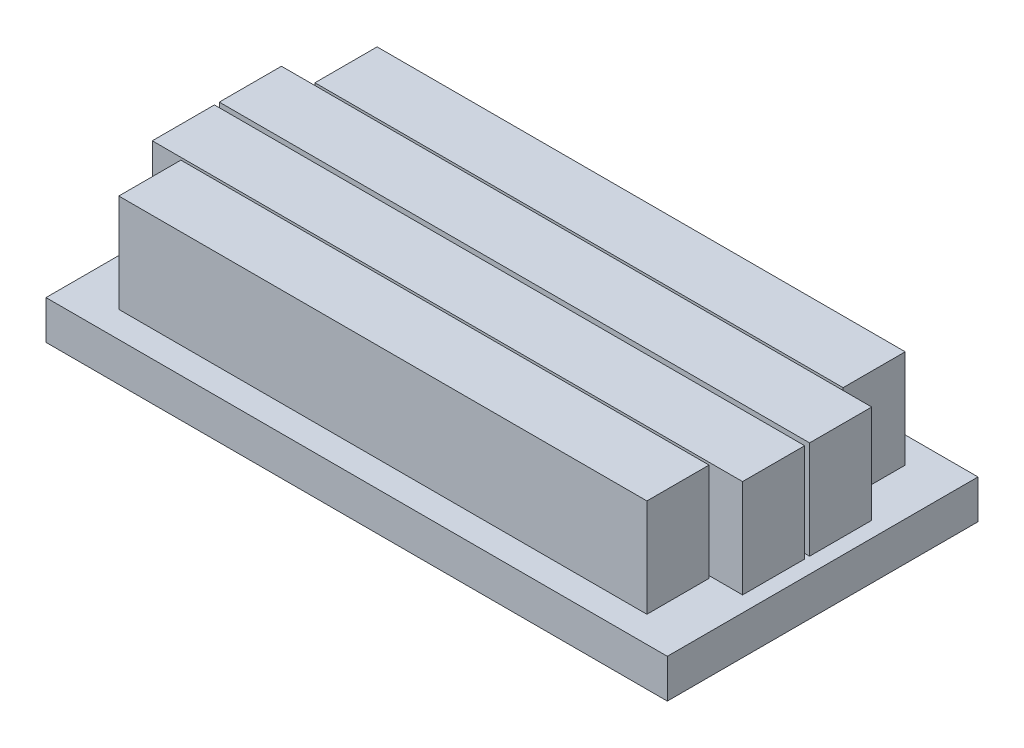
ISO-10303-21;
HEADER;
FILE_DESCRIPTION(('STEP AP214'),'2;1');
FILE_NAME('part.step','',(''),(''),'','','');
FILE_SCHEMA(('AUTOMOTIVE_DESIGN { 1 0 10303 214 1 1 1 1 }'));
ENDSEC;
DATA;
#1=APPLICATION_CONTEXT('core data for automotive mechanical design processes');
#2=APPLICATION_PROTOCOL_DEFINITION('international standard','automotive_design',2000,#1);
#3=PRODUCT_CONTEXT('',#1,'mechanical');
#4=PRODUCT('Part','Part','',(#3));
#5=PRODUCT_RELATED_PRODUCT_CATEGORY('part','',(#4));
#6=PRODUCT_DEFINITION_FORMATION('','',#4);
#7=PRODUCT_DEFINITION_CONTEXT('part definition',#1,'design');
#8=PRODUCT_DEFINITION('design','',#6,#7);
#9=PRODUCT_DEFINITION_SHAPE('','',#8);
#10=(LENGTH_UNIT() NAMED_UNIT(*) SI_UNIT(.MILLI.,.METRE.));
#11=(NAMED_UNIT(*) PLANE_ANGLE_UNIT() SI_UNIT($,.RADIAN.));
#12=(NAMED_UNIT(*) SI_UNIT($,.STERADIAN.) SOLID_ANGLE_UNIT());
#13=UNCERTAINTY_MEASURE_WITH_UNIT(LENGTH_MEASURE(1.E-05),#10,'distance_accuracy_value','');
#14=(GEOMETRIC_REPRESENTATION_CONTEXT(3) GLOBAL_UNCERTAINTY_ASSIGNED_CONTEXT((#13)) GLOBAL_UNIT_ASSIGNED_CONTEXT((#10,
#11,#12)) REPRESENTATION_CONTEXT('',''));
#15=CARTESIAN_POINT('',(0.,0.,0.));
#16=DIRECTION('',(0.,0.,1.));
#17=DIRECTION('',(1.,0.,0.));
#18=AXIS2_PLACEMENT_3D('',#15,#16,#17);
#19=CARTESIAN_POINT('',(0.,1.5875,0.));
#20=DIRECTION('',(0.,-1.,0.));
#21=DIRECTION('',(0.,0.,-1.));
#22=AXIS2_PLACEMENT_3D('',#19,#20,#21);
#23=PLANE('',#22);
#24=DIRECTION('',(-1.,0.,0.));
#25=VECTOR('',#24,1.);
#26=CARTESIAN_POINT('',(-10.795,1.5875,-2.74));
#27=LINE('',#26,#25);
#28=CARTESIAN_POINT('',(10.795,1.5875,-2.74));
#29=VERTEX_POINT('',#28);
#30=CARTESIAN_POINT('',(-10.795,1.5875,-2.74));
#31=VERTEX_POINT('',#30);
#32=EDGE_CURVE('E201',#29,#31,#27,.T.);
#33=ORIENTED_EDGE('',*,*,#32,.T.);
#34=DIRECTION('',(0.,0.,-1.));
#35=VECTOR('',#34,1.);
#36=CARTESIAN_POINT('',(-10.795,1.5875,-5.28000000000001));
#37=LINE('',#36,#35);
#38=CARTESIAN_POINT('',(-10.795,1.5875,-5.28000000000001));
#39=VERTEX_POINT('',#38);
#40=EDGE_CURVE('E175',#31,#39,#37,.T.);
#41=ORIENTED_EDGE('',*,*,#40,.T.);
#42=DIRECTION('',(1.,0.,0.));
#43=VECTOR('',#42,1.);
#44=CARTESIAN_POINT('',(-10.795,1.5875,-5.28000000000001));
#45=LINE('',#44,#43);
#46=CARTESIAN_POINT('',(10.795,1.5875,-5.28000000000001));
#47=VERTEX_POINT('',#46);
#48=EDGE_CURVE('E191',#39,#47,#45,.T.);
#49=ORIENTED_EDGE('',*,*,#48,.T.);
#50=DIRECTION('',(0.,0.,1.));
#51=VECTOR('',#50,1.);
#52=CARTESIAN_POINT('',(10.795,1.5875,-5.28000000000001));
#53=LINE('',#52,#51);
#54=EDGE_CURVE('E47',#47,#29,#53,.T.);
#55=ORIENTED_EDGE('',*,*,#54,.T.);
#56=EDGE_LOOP('',(#33,#41,#49,#55));
#57=FACE_BOUND('',#56,.T.);
#58=DIRECTION('',(-1.,0.,0.));
#59=VECTOR('',#58,1.);
#60=CARTESIAN_POINT('',(-12.065,1.5875,-0.0999999999999998));
#61=LINE('',#60,#59);
#62=CARTESIAN_POINT('',(12.065,1.5875,-0.0999999999999998));
#63=VERTEX_POINT('',#62);
#64=CARTESIAN_POINT('',(-12.065,1.5875,-0.0999999999999998));
#65=VERTEX_POINT('',#64);
#66=EDGE_CURVE('E226',#63,#65,#61,.T.);
#67=ORIENTED_EDGE('',*,*,#66,.T.);
#68=DIRECTION('',(0.,0.,-1.));
#69=VECTOR('',#68,1.);
#70=CARTESIAN_POINT('',(-12.065,1.5875,-0.0999999999999998));
#71=LINE('',#70,#69);
#72=CARTESIAN_POINT('',(-12.065,1.5875,-2.64));
#73=VERTEX_POINT('',#72);
#74=EDGE_CURVE('E180',#65,#73,#71,.T.);
#75=ORIENTED_EDGE('',*,*,#74,.T.);
#76=DIRECTION('',(1.,0.,0.));
#77=VECTOR('',#76,1.);
#78=CARTESIAN_POINT('',(-12.065,1.5875,-2.64));
#79=LINE('',#78,#77);
#80=CARTESIAN_POINT('',(12.065,1.5875,-2.64));
#81=VERTEX_POINT('',#80);
#82=EDGE_CURVE('E214',#73,#81,#79,.T.);
#83=ORIENTED_EDGE('',*,*,#82,.T.);
#84=DIRECTION('',(0.,0.,1.));
#85=VECTOR('',#84,1.);
#86=CARTESIAN_POINT('',(12.065,1.5875,-0.0999999999999998));
#87=LINE('',#86,#85);
#88=EDGE_CURVE('E55',#81,#63,#87,.T.);
#89=ORIENTED_EDGE('',*,*,#88,.T.);
#90=EDGE_LOOP('',(#67,#75,#83,#89));
#91=FACE_BOUND('',#90,.T.);
#92=DIRECTION('',(0.,0.,1.));
#93=VECTOR('',#92,1.);
#94=CARTESIAN_POINT('',(-12.065,1.5875,0.0999999999999998));
#95=LINE('',#94,#93);
#96=CARTESIAN_POINT('',(-12.065,1.5875,0.0999999999999998));
#97=VERTEX_POINT('',#96);
#98=CARTESIAN_POINT('',(-12.065,1.5875,2.64));
#99=VERTEX_POINT('',#98);
#100=EDGE_CURVE('E272',#97,#99,#95,.T.);
#101=ORIENTED_EDGE('',*,*,#100,.F.);
#102=DIRECTION('',(-1.,0.,0.));
#103=VECTOR('',#102,1.);
#104=CARTESIAN_POINT('',(-12.065,1.5875,0.0999999999999998));
#105=LINE('',#104,#103);
#106=CARTESIAN_POINT('',(12.065,1.5875,0.0999999999999998));
#107=VERTEX_POINT('',#106);
#108=EDGE_CURVE('E277',#107,#97,#105,.T.);
#109=ORIENTED_EDGE('',*,*,#108,.F.);
#110=DIRECTION('',(0.,0.,-1.));
#111=VECTOR('',#110,1.);
#112=CARTESIAN_POINT('',(12.065,1.5875,0.0999999999999998));
#113=LINE('',#112,#111);
#114=CARTESIAN_POINT('',(12.065,1.5875,2.64));
#115=VERTEX_POINT('',#114);
#116=EDGE_CURVE('E289',#115,#107,#113,.T.);
#117=ORIENTED_EDGE('',*,*,#116,.F.);
#118=DIRECTION('',(1.,0.,0.));
#119=VECTOR('',#118,1.);
#120=CARTESIAN_POINT('',(-12.065,1.5875,2.64));
#121=LINE('',#120,#119);
#122=EDGE_CURVE('E286',#99,#115,#121,.T.);
#123=ORIENTED_EDGE('',*,*,#122,.F.);
#124=EDGE_LOOP('',(#101,#109,#117,#123));
#125=FACE_BOUND('',#124,.T.);
#126=DIRECTION('',(0.,0.,1.));
#127=VECTOR('',#126,1.);
#128=CARTESIAN_POINT('',(-12.7,1.5875,6.35));
#129=LINE('',#128,#127);
#130=CARTESIAN_POINT('',(-12.7,1.5875,-6.35));
#131=VERTEX_POINT('',#130);
#132=CARTESIAN_POINT('',(-12.7,1.5875,6.35));
#133=VERTEX_POINT('',#132);
#134=EDGE_CURVE('E306',#131,#133,#129,.T.);
#135=ORIENTED_EDGE('',*,*,#134,.T.);
#136=DIRECTION('',(1.,0.,0.));
#137=VECTOR('',#136,1.);
#138=CARTESIAN_POINT('',(-12.7,1.5875,6.35));
#139=LINE('',#138,#137);
#140=CARTESIAN_POINT('',(12.7,1.5875,6.35));
#141=VERTEX_POINT('',#140);
#142=EDGE_CURVE('E309',#133,#141,#139,.T.);
#143=ORIENTED_EDGE('',*,*,#142,.T.);
#144=DIRECTION('',(0.,0.,-1.));
#145=VECTOR('',#144,1.);
#146=CARTESIAN_POINT('',(12.7,1.5875,6.35));
#147=LINE('',#146,#145);
#148=CARTESIAN_POINT('',(12.7,1.5875,-6.35));
#149=VERTEX_POINT('',#148);
#150=EDGE_CURVE('E312',#141,#149,#147,.T.);
#151=ORIENTED_EDGE('',*,*,#150,.T.);
#152=DIRECTION('',(-1.,0.,0.));
#153=VECTOR('',#152,1.);
#154=CARTESIAN_POINT('',(-12.7,1.5875,-6.35));
#155=LINE('',#154,#153);
#156=EDGE_CURVE('E314',#149,#131,#155,.T.);
#157=ORIENTED_EDGE('',*,*,#156,.T.);
#158=EDGE_LOOP('',(#135,#143,#151,#157));
#159=FACE_BOUND('',#158,.T.);
#160=DIRECTION('',(0.,0.,1.));
#161=VECTOR('',#160,1.);
#162=CARTESIAN_POINT('',(-10.795,1.5875,5.28000000000001));
#163=LINE('',#162,#161);
#164=CARTESIAN_POINT('',(-10.795,1.5875,2.74));
#165=VERTEX_POINT('',#164);
#166=CARTESIAN_POINT('',(-10.795,1.5875,5.28000000000001));
#167=VERTEX_POINT('',#166);
#168=EDGE_CURVE('E239',#165,#167,#163,.T.);
#169=ORIENTED_EDGE('',*,*,#168,.F.);
#170=DIRECTION('',(-1.,0.,0.));
#171=VECTOR('',#170,1.);
#172=CARTESIAN_POINT('',(-10.795,1.5875,2.74));
#173=LINE('',#172,#171);
#174=CARTESIAN_POINT('',(10.795,1.5875,2.74));
#175=VERTEX_POINT('',#174);
#176=EDGE_CURVE('E244',#175,#165,#173,.T.);
#177=ORIENTED_EDGE('',*,*,#176,.F.);
#178=DIRECTION('',(0.,0.,-1.));
#179=VECTOR('',#178,1.);
#180=CARTESIAN_POINT('',(10.795,1.5875,5.28000000000001));
#181=LINE('',#180,#179);
#182=CARTESIAN_POINT('',(10.795,1.5875,5.28000000000001));
#183=VERTEX_POINT('',#182);
#184=EDGE_CURVE('E256',#183,#175,#181,.T.);
#185=ORIENTED_EDGE('',*,*,#184,.F.);
#186=DIRECTION('',(1.,0.,0.));
#187=VECTOR('',#186,1.);
#188=CARTESIAN_POINT('',(-10.795,1.5875,5.28000000000001));
#189=LINE('',#188,#187);
#190=EDGE_CURVE('E253',#167,#183,#189,.T.);
#191=ORIENTED_EDGE('',*,*,#190,.F.);
#192=EDGE_LOOP('',(#169,#177,#185,#191));
#193=FACE_BOUND('',#192,.T.);
#194=ADVANCED_FACE('F32',(#57,#91,#125,#159,#193),#23,.F.);
#195=CARTESIAN_POINT('',(-12.7,1.5875,6.35));
#196=DIRECTION('',(1.,0.,0.));
#197=DIRECTION('',(0.,0.,-1.));
#198=AXIS2_PLACEMENT_3D('',#195,#196,#197);
#199=PLANE('',#198);
#200=DIRECTION('',(0.,0.,1.));
#201=VECTOR('',#200,1.);
#202=CARTESIAN_POINT('',(-12.7,0.,6.35));
#203=LINE('',#202,#201);
#204=CARTESIAN_POINT('',(-12.7,0.,-6.35));
#205=VERTEX_POINT('',#204);
#206=CARTESIAN_POINT('',(-12.7,0.,6.35));
#207=VERTEX_POINT('',#206);
#208=EDGE_CURVE('E305',#205,#207,#203,.T.);
#209=ORIENTED_EDGE('',*,*,#208,.T.);
#210=DIRECTION('',(0.,-1.,0.));
#211=VECTOR('',#210,1.);
#212=CARTESIAN_POINT('',(-12.7,1.5875,6.35));
#213=LINE('',#212,#211);
#214=EDGE_CURVE('E11',#133,#207,#213,.T.);
#215=ORIENTED_EDGE('',*,*,#214,.F.);
#216=ORIENTED_EDGE('',*,*,#134,.F.);
#217=DIRECTION('',(0.,-1.,0.));
#218=VECTOR('',#217,1.);
#219=CARTESIAN_POINT('',(-12.7,1.5875,-6.35));
#220=LINE('',#219,#218);
#221=EDGE_CURVE('E316',#131,#205,#220,.T.);
#222=ORIENTED_EDGE('',*,*,#221,.T.);
#223=EDGE_LOOP('',(#209,#215,#216,#222));
#224=FACE_BOUND('',#223,.T.);
#225=ADVANCED_FACE('F34',(#224),#199,.F.);
#226=CARTESIAN_POINT('',(-12.7,1.5875,6.35));
#227=DIRECTION('',(0.,0.,-1.));
#228=DIRECTION('',(-1.,0.,0.));
#229=AXIS2_PLACEMENT_3D('',#226,#227,#228);
#230=PLANE('',#229);
#231=DIRECTION('',(1.,0.,0.));
#232=VECTOR('',#231,1.);
#233=CARTESIAN_POINT('',(-12.7,0.,6.35));
#234=LINE('',#233,#232);
#235=CARTESIAN_POINT('',(12.7,0.,6.35));
#236=VERTEX_POINT('',#235);
#237=EDGE_CURVE('E319',#207,#236,#234,.T.);
#238=ORIENTED_EDGE('',*,*,#237,.T.);
#239=DIRECTION('',(0.,-1.,0.));
#240=VECTOR('',#239,1.);
#241=CARTESIAN_POINT('',(12.7,1.5875,6.35));
#242=LINE('',#241,#240);
#243=EDGE_CURVE('E40',#141,#236,#242,.T.);
#244=ORIENTED_EDGE('',*,*,#243,.F.);
#245=ORIENTED_EDGE('',*,*,#142,.F.);
#246=ORIENTED_EDGE('',*,*,#214,.T.);
#247=EDGE_LOOP('',(#238,#244,#245,#246));
#248=FACE_BOUND('',#247,.T.);
#249=ADVANCED_FACE('F349',(#248),#230,.F.);
#250=CARTESIAN_POINT('',(12.7,1.5875,6.35));
#251=DIRECTION('',(-1.,0.,0.));
#252=DIRECTION('',(0.,0.,1.));
#253=AXIS2_PLACEMENT_3D('',#250,#251,#252);
#254=PLANE('',#253);
#255=DIRECTION('',(0.,0.,-1.));
#256=VECTOR('',#255,1.);
#257=CARTESIAN_POINT('',(12.7,0.,6.35));
#258=LINE('',#257,#256);
#259=CARTESIAN_POINT('',(12.7,0.,-6.35));
#260=VERTEX_POINT('',#259);
#261=EDGE_CURVE('E321',#236,#260,#258,.T.);
#262=ORIENTED_EDGE('',*,*,#261,.T.);
#263=DIRECTION('',(0.,-1.,0.));
#264=VECTOR('',#263,1.);
#265=CARTESIAN_POINT('',(12.7,1.5875,-6.35));
#266=LINE('',#265,#264);
#267=EDGE_CURVE('E326',#149,#260,#266,.T.);
#268=ORIENTED_EDGE('',*,*,#267,.F.);
#269=ORIENTED_EDGE('',*,*,#150,.F.);
#270=ORIENTED_EDGE('',*,*,#243,.T.);
#271=EDGE_LOOP('',(#262,#268,#269,#270));
#272=FACE_BOUND('',#271,.T.);
#273=ADVANCED_FACE('F333',(#272),#254,.F.);
#274=CARTESIAN_POINT('',(-12.7,1.5875,-6.35));
#275=DIRECTION('',(0.,0.,1.));
#276=DIRECTION('',(1.,0.,0.));
#277=AXIS2_PLACEMENT_3D('',#274,#275,#276);
#278=PLANE('',#277);
#279=DIRECTION('',(-1.,0.,0.));
#280=VECTOR('',#279,1.);
#281=CARTESIAN_POINT('',(-12.7,0.,-6.35));
#282=LINE('',#281,#280);
#283=EDGE_CURVE('E310',#260,#205,#282,.T.);
#284=ORIENTED_EDGE('',*,*,#283,.T.);
#285=ORIENTED_EDGE('',*,*,#221,.F.);
#286=ORIENTED_EDGE('',*,*,#156,.F.);
#287=ORIENTED_EDGE('',*,*,#267,.T.);
#288=EDGE_LOOP('',(#284,#285,#286,#287));
#289=FACE_BOUND('',#288,.T.);
#290=ADVANCED_FACE('F342',(#289),#278,.F.);
#291=CARTESIAN_POINT('',(0.,0.,0.));
#292=DIRECTION('',(0.,-1.,0.));
#293=DIRECTION('',(0.,0.,-1.));
#294=AXIS2_PLACEMENT_3D('',#291,#292,#293);
#295=PLANE('',#294);
#296=ORIENTED_EDGE('',*,*,#208,.F.);
#297=ORIENTED_EDGE('',*,*,#283,.F.);
#298=ORIENTED_EDGE('',*,*,#261,.F.);
#299=ORIENTED_EDGE('',*,*,#237,.F.);
#300=EDGE_LOOP('',(#296,#297,#298,#299));
#301=FACE_BOUND('',#300,.T.);
#302=ADVANCED_FACE('F339',(#301),#295,.T.);
#303=CARTESIAN_POINT('',(-12.065,5.6007,0.0999999999999998));
#304=DIRECTION('',(1.,0.,0.));
#305=DIRECTION('',(0.,0.,-1.));
#306=AXIS2_PLACEMENT_3D('',#303,#304,#305);
#307=PLANE('',#306);
#308=ORIENTED_EDGE('',*,*,#100,.T.);
#309=DIRECTION('',(0.,-1.,0.));
#310=VECTOR('',#309,1.);
#311=CARTESIAN_POINT('',(-12.065,5.6007,2.64));
#312=LINE('',#311,#310);
#313=CARTESIAN_POINT('',(-12.065,5.6007,2.64));
#314=VERTEX_POINT('',#313);
#315=EDGE_CURVE('E302',#314,#99,#312,.T.);
#316=ORIENTED_EDGE('',*,*,#315,.F.);
#317=DIRECTION('',(0.,0.,1.));
#318=VECTOR('',#317,1.);
#319=CARTESIAN_POINT('',(-12.065,5.6007,0.0999999999999998));
#320=LINE('',#319,#318);
#321=CARTESIAN_POINT('',(-12.065,5.6007,0.0999999999999998));
#322=VERTEX_POINT('',#321);
#323=EDGE_CURVE('E273',#322,#314,#320,.T.);
#324=ORIENTED_EDGE('',*,*,#323,.F.);
#325=DIRECTION('',(0.,-1.,0.));
#326=VECTOR('',#325,1.);
#327=CARTESIAN_POINT('',(-12.065,5.6007,0.0999999999999998));
#328=LINE('',#327,#326);
#329=EDGE_CURVE('E283',#322,#97,#328,.T.);
#330=ORIENTED_EDGE('',*,*,#329,.T.);
#331=EDGE_LOOP('',(#308,#316,#324,#330));
#332=FACE_BOUND('',#331,.T.);
#333=ADVANCED_FACE('F364',(#332),#307,.F.);
#334=CARTESIAN_POINT('',(-12.065,5.6007,2.64));
#335=DIRECTION('',(0.,0.,-1.));
#336=DIRECTION('',(-1.,0.,0.));
#337=AXIS2_PLACEMENT_3D('',#334,#335,#336);
#338=PLANE('',#337);
#339=ORIENTED_EDGE('',*,*,#122,.T.);
#340=DIRECTION('',(0.,-1.,0.));
#341=VECTOR('',#340,1.);
#342=CARTESIAN_POINT('',(12.065,5.6007,2.64));
#343=LINE('',#342,#341);
#344=CARTESIAN_POINT('',(12.065,5.6007,2.64));
#345=VERTEX_POINT('',#344);
#346=EDGE_CURVE('E299',#345,#115,#343,.T.);
#347=ORIENTED_EDGE('',*,*,#346,.F.);
#348=DIRECTION('',(1.,0.,0.));
#349=VECTOR('',#348,1.);
#350=CARTESIAN_POINT('',(-12.065,5.6007,2.64));
#351=LINE('',#350,#349);
#352=EDGE_CURVE('E276',#314,#345,#351,.T.);
#353=ORIENTED_EDGE('',*,*,#352,.F.);
#354=ORIENTED_EDGE('',*,*,#315,.T.);
#355=EDGE_LOOP('',(#339,#347,#353,#354));
#356=FACE_BOUND('',#355,.T.);
#357=ADVANCED_FACE('F383',(#356),#338,.F.);
#358=CARTESIAN_POINT('',(12.065,5.6007,0.0999999999999998));
#359=DIRECTION('',(-1.,0.,0.));
#360=DIRECTION('',(0.,0.,1.));
#361=AXIS2_PLACEMENT_3D('',#358,#359,#360);
#362=PLANE('',#361);
#363=ORIENTED_EDGE('',*,*,#116,.T.);
#364=DIRECTION('',(0.,-1.,0.));
#365=VECTOR('',#364,1.);
#366=CARTESIAN_POINT('',(12.065,5.6007,0.0999999999999998));
#367=LINE('',#366,#365);
#368=CARTESIAN_POINT('',(12.065,5.6007,0.0999999999999998));
#369=VERTEX_POINT('',#368);
#370=EDGE_CURVE('E296',#369,#107,#367,.T.);
#371=ORIENTED_EDGE('',*,*,#370,.F.);
#372=DIRECTION('',(0.,0.,-1.));
#373=VECTOR('',#372,1.);
#374=CARTESIAN_POINT('',(12.065,5.6007,0.0999999999999998));
#375=LINE('',#374,#373);
#376=EDGE_CURVE('E279',#345,#369,#375,.T.);
#377=ORIENTED_EDGE('',*,*,#376,.F.);
#378=ORIENTED_EDGE('',*,*,#346,.T.);
#379=EDGE_LOOP('',(#363,#371,#377,#378));
#380=FACE_BOUND('',#379,.T.);
#381=ADVANCED_FACE('F390',(#380),#362,.F.);
#382=CARTESIAN_POINT('',(-12.065,5.6007,0.0999999999999998));
#383=DIRECTION('',(0.,0.,1.));
#384=DIRECTION('',(1.,0.,0.));
#385=AXIS2_PLACEMENT_3D('',#382,#383,#384);
#386=PLANE('',#385);
#387=ORIENTED_EDGE('',*,*,#108,.T.);
#388=ORIENTED_EDGE('',*,*,#329,.F.);
#389=DIRECTION('',(-1.,0.,0.));
#390=VECTOR('',#389,1.);
#391=CARTESIAN_POINT('',(-12.065,5.6007,0.0999999999999998));
#392=LINE('',#391,#390);
#393=EDGE_CURVE('E281',#369,#322,#392,.T.);
#394=ORIENTED_EDGE('',*,*,#393,.F.);
#395=ORIENTED_EDGE('',*,*,#370,.T.);
#396=EDGE_LOOP('',(#387,#388,#394,#395));
#397=FACE_BOUND('',#396,.T.);
#398=ADVANCED_FACE('F397',(#397),#386,.F.);
#399=CARTESIAN_POINT('',(0.,5.6007,0.));
#400=DIRECTION('',(0.,1.,0.));
#401=DIRECTION('',(0.,0.,1.));
#402=AXIS2_PLACEMENT_3D('',#399,#400,#401);
#403=PLANE('',#402);
#404=ORIENTED_EDGE('',*,*,#323,.T.);
#405=ORIENTED_EDGE('',*,*,#352,.T.);
#406=ORIENTED_EDGE('',*,*,#376,.T.);
#407=ORIENTED_EDGE('',*,*,#393,.T.);
#408=EDGE_LOOP('',(#404,#405,#406,#407));
#409=FACE_BOUND('',#408,.T.);
#410=ADVANCED_FACE('F405',(#409),#403,.T.);
#411=CARTESIAN_POINT('',(-10.795,5.6007,5.28000000000001));
#412=DIRECTION('',(1.,0.,0.));
#413=DIRECTION('',(0.,0.,-1.));
#414=AXIS2_PLACEMENT_3D('',#411,#412,#413);
#415=PLANE('',#414);
#416=ORIENTED_EDGE('',*,*,#168,.T.);
#417=DIRECTION('',(0.,-1.,0.));
#418=VECTOR('',#417,1.);
#419=CARTESIAN_POINT('',(-10.795,5.6007,5.28000000000001));
#420=LINE('',#419,#418);
#421=CARTESIAN_POINT('',(-10.795,5.6007,5.28000000000001));
#422=VERTEX_POINT('',#421);
#423=EDGE_CURVE('E269',#422,#167,#420,.T.);
#424=ORIENTED_EDGE('',*,*,#423,.F.);
#425=DIRECTION('',(0.,0.,1.));
#426=VECTOR('',#425,1.);
#427=CARTESIAN_POINT('',(-10.795,5.6007,5.28000000000001));
#428=LINE('',#427,#426);
#429=CARTESIAN_POINT('',(-10.795,5.6007,2.74));
#430=VERTEX_POINT('',#429);
#431=EDGE_CURVE('E240',#430,#422,#428,.T.);
#432=ORIENTED_EDGE('',*,*,#431,.F.);
#433=DIRECTION('',(0.,-1.,0.));
#434=VECTOR('',#433,1.);
#435=CARTESIAN_POINT('',(-10.795,5.6007,2.74));
#436=LINE('',#435,#434);
#437=EDGE_CURVE('E250',#430,#165,#436,.T.);
#438=ORIENTED_EDGE('',*,*,#437,.T.);
#439=EDGE_LOOP('',(#416,#424,#432,#438));
#440=FACE_BOUND('',#439,.T.);
#441=ADVANCED_FACE('F413',(#440),#415,.F.);
#442=CARTESIAN_POINT('',(-10.795,5.6007,5.28000000000001));
#443=DIRECTION('',(0.,0.,-1.));
#444=DIRECTION('',(-1.,0.,0.));
#445=AXIS2_PLACEMENT_3D('',#442,#443,#444);
#446=PLANE('',#445);
#447=ORIENTED_EDGE('',*,*,#190,.T.);
#448=DIRECTION('',(0.,-1.,0.));
#449=VECTOR('',#448,1.);
#450=CARTESIAN_POINT('',(10.795,5.6007,5.28000000000001));
#451=LINE('',#450,#449);
#452=CARTESIAN_POINT('',(10.795,5.6007,5.28000000000001));
#453=VERTEX_POINT('',#452);
#454=EDGE_CURVE('E266',#453,#183,#451,.T.);
#455=ORIENTED_EDGE('',*,*,#454,.F.);
#456=DIRECTION('',(1.,0.,0.));
#457=VECTOR('',#456,1.);
#458=CARTESIAN_POINT('',(-10.795,5.6007,5.28000000000001));
#459=LINE('',#458,#457);
#460=EDGE_CURVE('E243',#422,#453,#459,.T.);
#461=ORIENTED_EDGE('',*,*,#460,.F.);
#462=ORIENTED_EDGE('',*,*,#423,.T.);
#463=EDGE_LOOP('',(#447,#455,#461,#462));
#464=FACE_BOUND('',#463,.T.);
#465=ADVANCED_FACE('F421',(#464),#446,.F.);
#466=CARTESIAN_POINT('',(10.795,5.6007,5.28000000000001));
#467=DIRECTION('',(-1.,0.,0.));
#468=DIRECTION('',(0.,0.,1.));
#469=AXIS2_PLACEMENT_3D('',#466,#467,#468);
#470=PLANE('',#469);
#471=ORIENTED_EDGE('',*,*,#184,.T.);
#472=DIRECTION('',(0.,-1.,0.));
#473=VECTOR('',#472,1.);
#474=CARTESIAN_POINT('',(10.795,5.6007,2.74));
#475=LINE('',#474,#473);
#476=CARTESIAN_POINT('',(10.795,5.6007,2.74));
#477=VERTEX_POINT('',#476);
#478=EDGE_CURVE('E263',#477,#175,#475,.T.);
#479=ORIENTED_EDGE('',*,*,#478,.F.);
#480=DIRECTION('',(0.,0.,-1.));
#481=VECTOR('',#480,1.);
#482=CARTESIAN_POINT('',(10.795,5.6007,5.28000000000001));
#483=LINE('',#482,#481);
#484=EDGE_CURVE('E246',#453,#477,#483,.T.);
#485=ORIENTED_EDGE('',*,*,#484,.F.);
#486=ORIENTED_EDGE('',*,*,#454,.T.);
#487=EDGE_LOOP('',(#471,#479,#485,#486));
#488=FACE_BOUND('',#487,.T.);
#489=ADVANCED_FACE('F429',(#488),#470,.F.);
#490=CARTESIAN_POINT('',(-10.795,5.6007,2.74));
#491=DIRECTION('',(0.,0.,1.));
#492=DIRECTION('',(1.,0.,0.));
#493=AXIS2_PLACEMENT_3D('',#490,#491,#492);
#494=PLANE('',#493);
#495=ORIENTED_EDGE('',*,*,#176,.T.);
#496=ORIENTED_EDGE('',*,*,#437,.F.);
#497=DIRECTION('',(-1.,0.,0.));
#498=VECTOR('',#497,1.);
#499=CARTESIAN_POINT('',(-10.795,5.6007,2.74));
#500=LINE('',#499,#498);
#501=EDGE_CURVE('E248',#477,#430,#500,.T.);
#502=ORIENTED_EDGE('',*,*,#501,.F.);
#503=ORIENTED_EDGE('',*,*,#478,.T.);
#504=EDGE_LOOP('',(#495,#496,#502,#503));
#505=FACE_BOUND('',#504,.T.);
#506=ADVANCED_FACE('F437',(#505),#494,.F.);
#507=CARTESIAN_POINT('',(0.,5.6007,0.));
#508=DIRECTION('',(0.,-1.,0.));
#509=DIRECTION('',(0.,0.,-1.));
#510=AXIS2_PLACEMENT_3D('',#507,#508,#509);
#511=PLANE('',#510);
#512=ORIENTED_EDGE('',*,*,#431,.T.);
#513=ORIENTED_EDGE('',*,*,#460,.T.);
#514=ORIENTED_EDGE('',*,*,#484,.T.);
#515=ORIENTED_EDGE('',*,*,#501,.T.);
#516=EDGE_LOOP('',(#512,#513,#514,#515));
#517=FACE_BOUND('',#516,.T.);
#518=ADVANCED_FACE('F445',(#517),#511,.F.);
#519=CARTESIAN_POINT('',(-12.065,5.6007,-0.0999999999999998));
#520=DIRECTION('',(-1.,0.,0.));
#521=DIRECTION('',(0.,0.,1.));
#522=AXIS2_PLACEMENT_3D('',#519,#520,#521);
#523=PLANE('',#522);
#524=ORIENTED_EDGE('',*,*,#74,.F.);
#525=DIRECTION('',(0.,-1.,0.));
#526=VECTOR('',#525,1.);
#527=CARTESIAN_POINT('',(-12.065,5.6007,-0.0999999999999998));
#528=LINE('',#527,#526);
#529=CARTESIAN_POINT('',(-12.065,5.6007,-0.0999999999999998));
#530=VERTEX_POINT('',#529);
#531=EDGE_CURVE('E237',#530,#65,#528,.T.);
#532=ORIENTED_EDGE('',*,*,#531,.F.);
#533=DIRECTION('',(0.,0.,-1.));
#534=VECTOR('',#533,1.);
#535=CARTESIAN_POINT('',(-12.065,5.6007,-0.0999999999999998));
#536=LINE('',#535,#534);
#537=CARTESIAN_POINT('',(-12.065,5.6007,-2.64));
#538=VERTEX_POINT('',#537);
#539=EDGE_CURVE('E210',#530,#538,#536,.T.);
#540=ORIENTED_EDGE('',*,*,#539,.T.);
#541=DIRECTION('',(0.,-1.,0.));
#542=VECTOR('',#541,1.);
#543=CARTESIAN_POINT('',(-12.065,5.6007,-2.64));
#544=LINE('',#543,#542);
#545=EDGE_CURVE('E223',#538,#73,#544,.T.);
#546=ORIENTED_EDGE('',*,*,#545,.T.);
#547=EDGE_LOOP('',(#524,#532,#540,#546));
#548=FACE_BOUND('',#547,.T.);
#549=ADVANCED_FACE('F453',(#548),#523,.T.);
#550=CARTESIAN_POINT('',(-12.065,5.6007,-0.0999999999999998));
#551=DIRECTION('',(0.,0.,1.));
#552=DIRECTION('',(1.,0.,0.));
#553=AXIS2_PLACEMENT_3D('',#550,#551,#552);
#554=PLANE('',#553);
#555=ORIENTED_EDGE('',*,*,#66,.F.);
#556=DIRECTION('',(0.,-1.,0.));
#557=VECTOR('',#556,1.);
#558=CARTESIAN_POINT('',(12.065,5.6007,-0.0999999999999998));
#559=LINE('',#558,#557);
#560=CARTESIAN_POINT('',(12.065,5.6007,-0.0999999999999998));
#561=VERTEX_POINT('',#560);
#562=EDGE_CURVE('E235',#561,#63,#559,.T.);
#563=ORIENTED_EDGE('',*,*,#562,.F.);
#564=DIRECTION('',(-1.,0.,0.));
#565=VECTOR('',#564,1.);
#566=CARTESIAN_POINT('',(-12.065,5.6007,-0.0999999999999998));
#567=LINE('',#566,#565);
#568=EDGE_CURVE('E213',#561,#530,#567,.T.);
#569=ORIENTED_EDGE('',*,*,#568,.T.);
#570=ORIENTED_EDGE('',*,*,#531,.T.);
#571=EDGE_LOOP('',(#555,#563,#569,#570));
#572=FACE_BOUND('',#571,.T.);
#573=ADVANCED_FACE('F461',(#572),#554,.T.);
#574=CARTESIAN_POINT('',(12.065,5.6007,-0.0999999999999998));
#575=DIRECTION('',(1.,0.,0.));
#576=DIRECTION('',(0.,0.,-1.));
#577=AXIS2_PLACEMENT_3D('',#574,#575,#576);
#578=PLANE('',#577);
#579=ORIENTED_EDGE('',*,*,#88,.F.);
#580=DIRECTION('',(0.,-1.,0.));
#581=VECTOR('',#580,1.);
#582=CARTESIAN_POINT('',(12.065,5.6007,-2.64));
#583=LINE('',#582,#581);
#584=CARTESIAN_POINT('',(12.065,5.6007,-2.64));
#585=VERTEX_POINT('',#584);
#586=EDGE_CURVE('E233',#585,#81,#583,.T.);
#587=ORIENTED_EDGE('',*,*,#586,.F.);
#588=DIRECTION('',(0.,0.,1.));
#589=VECTOR('',#588,1.);
#590=CARTESIAN_POINT('',(12.065,5.6007,-0.0999999999999998));
#591=LINE('',#590,#589);
#592=EDGE_CURVE('E217',#585,#561,#591,.T.);
#593=ORIENTED_EDGE('',*,*,#592,.T.);
#594=ORIENTED_EDGE('',*,*,#562,.T.);
#595=EDGE_LOOP('',(#579,#587,#593,#594));
#596=FACE_BOUND('',#595,.T.);
#597=ADVANCED_FACE('F469',(#596),#578,.T.);
#598=CARTESIAN_POINT('',(-12.065,5.6007,-2.64));
#599=DIRECTION('',(0.,0.,-1.));
#600=DIRECTION('',(-1.,0.,0.));
#601=AXIS2_PLACEMENT_3D('',#598,#599,#600);
#602=PLANE('',#601);
#603=ORIENTED_EDGE('',*,*,#82,.F.);
#604=ORIENTED_EDGE('',*,*,#545,.F.);
#605=DIRECTION('',(1.,0.,0.));
#606=VECTOR('',#605,1.);
#607=CARTESIAN_POINT('',(-12.065,5.6007,-2.64));
#608=LINE('',#607,#606);
#609=EDGE_CURVE('E220',#538,#585,#608,.T.);
#610=ORIENTED_EDGE('',*,*,#609,.T.);
#611=ORIENTED_EDGE('',*,*,#586,.T.);
#612=EDGE_LOOP('',(#603,#604,#610,#611));
#613=FACE_BOUND('',#612,.T.);
#614=ADVANCED_FACE('F477',(#613),#602,.T.);
#615=CARTESIAN_POINT('',(0.,5.6007,0.));
#616=DIRECTION('',(0.,1.,0.));
#617=DIRECTION('',(0.,0.,-1.));
#618=AXIS2_PLACEMENT_3D('',#615,#616,#617);
#619=PLANE('',#618);
#620=ORIENTED_EDGE('',*,*,#539,.F.);
#621=ORIENTED_EDGE('',*,*,#568,.F.);
#622=ORIENTED_EDGE('',*,*,#592,.F.);
#623=ORIENTED_EDGE('',*,*,#609,.F.);
#624=EDGE_LOOP('',(#620,#621,#622,#623));
#625=FACE_BOUND('',#624,.T.);
#626=ADVANCED_FACE('F484',(#625),#619,.T.);
#627=CARTESIAN_POINT('',(-10.795,5.6007,-5.28000000000001));
#628=DIRECTION('',(-1.,0.,0.));
#629=DIRECTION('',(0.,0.,1.));
#630=AXIS2_PLACEMENT_3D('',#627,#628,#629);
#631=PLANE('',#630);
#632=ORIENTED_EDGE('',*,*,#40,.F.);
#633=DIRECTION('',(0.,-1.,0.));
#634=VECTOR('',#633,1.);
#635=CARTESIAN_POINT('',(-10.795,5.6007,-2.74));
#636=LINE('',#635,#634);
#637=CARTESIAN_POINT('',(-10.795,5.6007,-2.74));
#638=VERTEX_POINT('',#637);
#639=EDGE_CURVE('E169',#638,#31,#636,.T.);
#640=ORIENTED_EDGE('',*,*,#639,.F.);
#641=DIRECTION('',(0.,0.,-1.));
#642=VECTOR('',#641,1.);
#643=CARTESIAN_POINT('',(-10.795,5.6007,-5.28000000000001));
#644=LINE('',#643,#642);
#645=CARTESIAN_POINT('',(-10.795,5.6007,-5.28000000000001));
#646=VERTEX_POINT('',#645);
#647=EDGE_CURVE('E172',#638,#646,#644,.T.);
#648=ORIENTED_EDGE('',*,*,#647,.T.);
#649=DIRECTION('',(0.,-1.,0.));
#650=VECTOR('',#649,1.);
#651=CARTESIAN_POINT('',(-10.795,5.6007,-5.28000000000001));
#652=LINE('',#651,#650);
#653=EDGE_CURVE('E199',#646,#39,#652,.T.);
#654=ORIENTED_EDGE('',*,*,#653,.T.);
#655=EDGE_LOOP('',(#632,#640,#648,#654));
#656=FACE_BOUND('',#655,.T.);
#657=ADVANCED_FACE('F171',(#656),#631,.T.);
#658=CARTESIAN_POINT('',(-10.795,5.6007,-2.74));
#659=DIRECTION('',(0.,0.,1.));
#660=DIRECTION('',(1.,0.,0.));
#661=AXIS2_PLACEMENT_3D('',#658,#659,#660);
#662=PLANE('',#661);
#663=ORIENTED_EDGE('',*,*,#32,.F.);
#664=DIRECTION('',(0.,-1.,0.));
#665=VECTOR('',#664,1.);
#666=CARTESIAN_POINT('',(10.795,5.6007,-2.74));
#667=LINE('',#666,#665);
#668=CARTESIAN_POINT('',(10.795,5.6007,-2.74));
#669=VERTEX_POINT('',#668);
#670=EDGE_CURVE('E181',#669,#29,#667,.T.);
#671=ORIENTED_EDGE('',*,*,#670,.F.);
#672=DIRECTION('',(-1.,0.,0.));
#673=VECTOR('',#672,1.);
#674=CARTESIAN_POINT('',(-10.795,5.6007,-2.74));
#675=LINE('',#674,#673);
#676=EDGE_CURVE('E187',#669,#638,#675,.T.);
#677=ORIENTED_EDGE('',*,*,#676,.T.);
#678=ORIENTED_EDGE('',*,*,#639,.T.);
#679=EDGE_LOOP('',(#663,#671,#677,#678));
#680=FACE_BOUND('',#679,.T.);
#681=ADVANCED_FACE('F193',(#680),#662,.T.);
#682=CARTESIAN_POINT('',(10.795,5.6007,-5.28000000000001));
#683=DIRECTION('',(1.,0.,0.));
#684=DIRECTION('',(0.,0.,-1.));
#685=AXIS2_PLACEMENT_3D('',#682,#683,#684);
#686=PLANE('',#685);
#687=ORIENTED_EDGE('',*,*,#54,.F.);
#688=DIRECTION('',(0.,-1.,0.));
#689=VECTOR('',#688,1.);
#690=CARTESIAN_POINT('',(10.795,5.6007,-5.28000000000001));
#691=LINE('',#690,#689);
#692=CARTESIAN_POINT('',(10.795,5.6007,-5.28000000000001));
#693=VERTEX_POINT('',#692);
#694=EDGE_CURVE('E207',#693,#47,#691,.T.);
#695=ORIENTED_EDGE('',*,*,#694,.F.);
#696=DIRECTION('',(0.,0.,1.));
#697=VECTOR('',#696,1.);
#698=CARTESIAN_POINT('',(10.795,5.6007,-5.28000000000001));
#699=LINE('',#698,#697);
#700=EDGE_CURVE('E194',#693,#669,#699,.T.);
#701=ORIENTED_EDGE('',*,*,#700,.T.);
#702=ORIENTED_EDGE('',*,*,#670,.T.);
#703=EDGE_LOOP('',(#687,#695,#701,#702));
#704=FACE_BOUND('',#703,.T.);
#705=ADVANCED_FACE('F505',(#704),#686,.T.);
#706=CARTESIAN_POINT('',(-10.795,5.6007,-5.28000000000001));
#707=DIRECTION('',(0.,0.,-1.));
#708=DIRECTION('',(-1.,0.,0.));
#709=AXIS2_PLACEMENT_3D('',#706,#707,#708);
#710=PLANE('',#709);
#711=ORIENTED_EDGE('',*,*,#48,.F.);
#712=ORIENTED_EDGE('',*,*,#653,.F.);
#713=DIRECTION('',(1.,0.,0.));
#714=VECTOR('',#713,1.);
#715=CARTESIAN_POINT('',(-10.795,5.6007,-5.28000000000001));
#716=LINE('',#715,#714);
#717=EDGE_CURVE('E190',#646,#693,#716,.T.);
#718=ORIENTED_EDGE('',*,*,#717,.T.);
#719=ORIENTED_EDGE('',*,*,#694,.T.);
#720=EDGE_LOOP('',(#711,#712,#718,#719));
#721=FACE_BOUND('',#720,.T.);
#722=ADVANCED_FACE('F512',(#721),#710,.T.);
#723=CARTESIAN_POINT('',(0.,5.6007,0.));
#724=DIRECTION('',(0.,-1.,0.));
#725=DIRECTION('',(0.,0.,1.));
#726=AXIS2_PLACEMENT_3D('',#723,#724,#725);
#727=PLANE('',#726);
#728=ORIENTED_EDGE('',*,*,#647,.F.);
#729=ORIENTED_EDGE('',*,*,#676,.F.);
#730=ORIENTED_EDGE('',*,*,#700,.F.);
#731=ORIENTED_EDGE('',*,*,#717,.F.);
#732=EDGE_LOOP('',(#728,#729,#730,#731));
#733=FACE_BOUND('',#732,.T.);
#734=ADVANCED_FACE('F185',(#733),#727,.F.);
#735=CLOSED_SHELL('',(#194,#225,#249,#273,#290,#302,#333,#357,#381,#398,#410,#441,#465,#489,
#506,#518,#549,#573,#597,#614,#626,#657,#681,#705,#722,#734));
#736=MANIFOLD_SOLID_BREP('B2',#735);
#737=ADVANCED_BREP_SHAPE_REPRESENTATION('',(#18,#736),#14);
#738=SHAPE_DEFINITION_REPRESENTATION(#9,#737);
ENDSEC;
END-ISO-10303-21;
